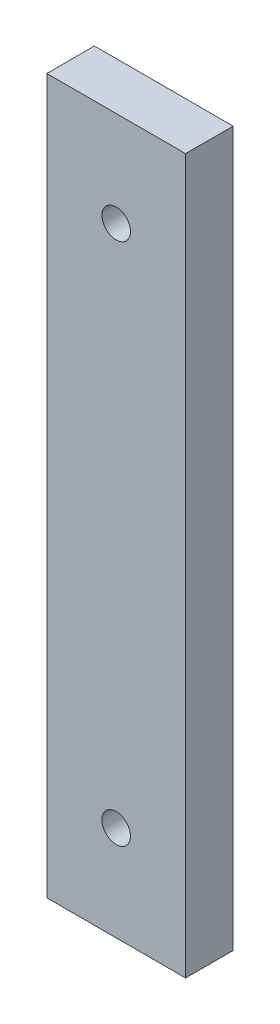
ISO-10303-21;
HEADER;
FILE_DESCRIPTION(('STEP AP214'),'2;1');
FILE_NAME('part.step','',(''),(''),'','','');
FILE_SCHEMA(('AUTOMOTIVE_DESIGN { 1 0 10303 214 1 1 1 1 }'));
ENDSEC;
DATA;
#1=APPLICATION_CONTEXT('core data for automotive mechanical design processes');
#2=APPLICATION_PROTOCOL_DEFINITION('international standard','automotive_design',2000,#1);
#3=PRODUCT_CONTEXT('',#1,'mechanical');
#4=PRODUCT('Part','Part','',(#3));
#5=PRODUCT_RELATED_PRODUCT_CATEGORY('part','',(#4));
#6=PRODUCT_DEFINITION_FORMATION('','',#4);
#7=PRODUCT_DEFINITION_CONTEXT('part definition',#1,'design');
#8=PRODUCT_DEFINITION('design','',#6,#7);
#9=PRODUCT_DEFINITION_SHAPE('','',#8);
#10=(LENGTH_UNIT() NAMED_UNIT(*) SI_UNIT(.MILLI.,.METRE.));
#11=(NAMED_UNIT(*) PLANE_ANGLE_UNIT() SI_UNIT($,.RADIAN.));
#12=(NAMED_UNIT(*) SI_UNIT($,.STERADIAN.) SOLID_ANGLE_UNIT());
#13=UNCERTAINTY_MEASURE_WITH_UNIT(LENGTH_MEASURE(1.E-05),#10,'distance_accuracy_value','');
#14=(GEOMETRIC_REPRESENTATION_CONTEXT(3) GLOBAL_UNCERTAINTY_ASSIGNED_CONTEXT((#13)) GLOBAL_UNIT_ASSIGNED_CONTEXT((#10,
#11,#12)) REPRESENTATION_CONTEXT('',''));
#15=CARTESIAN_POINT('',(0.,0.,0.));
#16=DIRECTION('',(0.,0.,1.));
#17=DIRECTION('',(1.,0.,0.));
#18=AXIS2_PLACEMENT_3D('',#15,#16,#17);
#19=CARTESIAN_POINT('',(0.,0.,10.));
#20=DIRECTION('',(0.,0.,-1.));
#21=DIRECTION('',(-1.,0.,0.));
#22=AXIS2_PLACEMENT_3D('',#19,#20,#21);
#23=PLANE('',#22);
#24=DIRECTION('',(0.,1.,0.));
#25=VECTOR('',#24,1.);
#26=CARTESIAN_POINT('',(14.5788336933045,-75.,10.));
#27=LINE('',#26,#25);
#28=CARTESIAN_POINT('',(14.5788336933045,-75.,10.));
#29=VERTEX_POINT('',#28);
#30=CARTESIAN_POINT('',(14.5788336933045,75.,10.));
#31=VERTEX_POINT('',#30);
#32=EDGE_CURVE('E92',#29,#31,#27,.T.);
#33=ORIENTED_EDGE('',*,*,#32,.T.);
#34=DIRECTION('',(-1.,0.,0.));
#35=VECTOR('',#34,1.);
#36=CARTESIAN_POINT('',(-14.5788336933045,75.,10.));
#37=LINE('',#36,#35);
#38=CARTESIAN_POINT('',(-14.5788336933045,75.,10.));
#39=VERTEX_POINT('',#38);
#40=EDGE_CURVE('E87',#31,#39,#37,.T.);
#41=ORIENTED_EDGE('',*,*,#40,.T.);
#42=DIRECTION('',(0.,-1.,0.));
#43=VECTOR('',#42,1.);
#44=CARTESIAN_POINT('',(-14.5788336933045,-75.,10.));
#45=LINE('',#44,#43);
#46=CARTESIAN_POINT('',(-14.5788336933045,-75.,10.));
#47=VERTEX_POINT('',#46);
#48=EDGE_CURVE('E90',#39,#47,#45,.T.);
#49=ORIENTED_EDGE('',*,*,#48,.T.);
#50=DIRECTION('',(1.,0.,0.));
#51=VECTOR('',#50,1.);
#52=CARTESIAN_POINT('',(-14.5788336933045,-75.,10.));
#53=LINE('',#52,#51);
#54=EDGE_CURVE('E57',#47,#29,#53,.T.);
#55=ORIENTED_EDGE('',*,*,#54,.T.);
#56=EDGE_LOOP('',(#33,#41,#49,#55));
#57=FACE_BOUND('',#56,.T.);
#58=CARTESIAN_POINT('',(0.,55.,10.));
#59=DIRECTION('',(0.,0.,1.));
#60=DIRECTION('',(1.,0.,0.));
#61=AXIS2_PLACEMENT_3D('',#58,#59,#60);
#62=CIRCLE('',#61,3.);
#63=CARTESIAN_POINT('',(3.,55.,10.));
#64=VERTEX_POINT('',#63);
#65=EDGE_CURVE('E112',#64,#64,#62,.T.);
#66=ORIENTED_EDGE('',*,*,#65,.F.);
#67=EDGE_LOOP('',(#66));
#68=FACE_BOUND('',#67,.T.);
#69=CARTESIAN_POINT('',(0.,-55.,10.));
#70=DIRECTION('',(0.,0.,1.));
#71=DIRECTION('',(1.,0.,0.));
#72=AXIS2_PLACEMENT_3D('',#69,#70,#71);
#73=CIRCLE('',#72,3.);
#74=CARTESIAN_POINT('',(3.,-55.,10.));
#75=VERTEX_POINT('',#74);
#76=EDGE_CURVE('E134',#75,#75,#73,.T.);
#77=ORIENTED_EDGE('',*,*,#76,.F.);
#78=EDGE_LOOP('',(#77));
#79=FACE_BOUND('',#78,.T.);
#80=ADVANCED_FACE('F39',(#57,#68,#79),#23,.F.);
#81=CARTESIAN_POINT('',(0.,0.,0.));
#82=DIRECTION('',(0.,0.,-1.));
#83=DIRECTION('',(-1.,0.,0.));
#84=AXIS2_PLACEMENT_3D('',#81,#82,#83);
#85=PLANE('',#84);
#86=CARTESIAN_POINT('',(0.,55.,0.));
#87=DIRECTION('',(0.,0.,1.));
#88=DIRECTION('',(1.,0.,0.));
#89=AXIS2_PLACEMENT_3D('',#86,#87,#88);
#90=CIRCLE('',#89,3.);
#91=CARTESIAN_POINT('',(3.,55.,0.));
#92=VERTEX_POINT('',#91);
#93=EDGE_CURVE('E130',#92,#92,#90,.T.);
#94=ORIENTED_EDGE('',*,*,#93,.T.);
#95=EDGE_LOOP('',(#94));
#96=FACE_BOUND('',#95,.T.);
#97=DIRECTION('',(0.,1.,0.));
#98=VECTOR('',#97,1.);
#99=CARTESIAN_POINT('',(14.5788336933045,-75.,0.));
#100=LINE('',#99,#98);
#101=CARTESIAN_POINT('',(14.5788336933045,-75.,0.));
#102=VERTEX_POINT('',#101);
#103=CARTESIAN_POINT('',(14.5788336933045,75.,0.));
#104=VERTEX_POINT('',#103);
#105=EDGE_CURVE('E108',#102,#104,#100,.T.);
#106=ORIENTED_EDGE('',*,*,#105,.F.);
#107=DIRECTION('',(1.,0.,0.));
#108=VECTOR('',#107,1.);
#109=CARTESIAN_POINT('',(-14.5788336933045,-75.,0.));
#110=LINE('',#109,#108);
#111=CARTESIAN_POINT('',(-14.5788336933045,-75.,0.));
#112=VERTEX_POINT('',#111);
#113=EDGE_CURVE('E80',#112,#102,#110,.T.);
#114=ORIENTED_EDGE('',*,*,#113,.F.);
#115=DIRECTION('',(0.,-1.,0.));
#116=VECTOR('',#115,1.);
#117=CARTESIAN_POINT('',(-14.5788336933045,-75.,0.));
#118=LINE('',#117,#116);
#119=CARTESIAN_POINT('',(-14.5788336933045,75.,0.));
#120=VERTEX_POINT('',#119);
#121=EDGE_CURVE('E74',#120,#112,#118,.T.);
#122=ORIENTED_EDGE('',*,*,#121,.F.);
#123=DIRECTION('',(-1.,0.,0.));
#124=VECTOR('',#123,1.);
#125=CARTESIAN_POINT('',(-14.5788336933045,75.,0.));
#126=LINE('',#125,#124);
#127=EDGE_CURVE('E97',#104,#120,#126,.T.);
#128=ORIENTED_EDGE('',*,*,#127,.F.);
#129=EDGE_LOOP('',(#106,#114,#122,#128));
#130=FACE_BOUND('',#129,.T.);
#131=CARTESIAN_POINT('',(0.,-55.,0.));
#132=DIRECTION('',(0.,0.,1.));
#133=DIRECTION('',(1.,0.,0.));
#134=AXIS2_PLACEMENT_3D('',#131,#132,#133);
#135=CIRCLE('',#134,3.);
#136=CARTESIAN_POINT('',(3.,-55.,0.));
#137=VERTEX_POINT('',#136);
#138=EDGE_CURVE('E138',#137,#137,#135,.T.);
#139=ORIENTED_EDGE('',*,*,#138,.T.);
#140=EDGE_LOOP('',(#139));
#141=FACE_BOUND('',#140,.T.);
#142=ADVANCED_FACE('F125',(#96,#130,#141),#85,.T.);
#143=CARTESIAN_POINT('',(14.5788336933045,-75.,10.));
#144=DIRECTION('',(-1.,0.,0.));
#145=DIRECTION('',(0.,0.,1.));
#146=AXIS2_PLACEMENT_3D('',#143,#144,#145);
#147=PLANE('',#146);
#148=ORIENTED_EDGE('',*,*,#105,.T.);
#149=DIRECTION('',(0.,0.,-1.));
#150=VECTOR('',#149,1.);
#151=CARTESIAN_POINT('',(14.5788336933045,75.,10.));
#152=LINE('',#151,#150);
#153=EDGE_CURVE('E11',#31,#104,#152,.T.);
#154=ORIENTED_EDGE('',*,*,#153,.F.);
#155=ORIENTED_EDGE('',*,*,#32,.F.);
#156=DIRECTION('',(0.,0.,-1.));
#157=VECTOR('',#156,1.);
#158=CARTESIAN_POINT('',(14.5788336933045,-75.,10.));
#159=LINE('',#158,#157);
#160=EDGE_CURVE('E104',#29,#102,#159,.T.);
#161=ORIENTED_EDGE('',*,*,#160,.T.);
#162=EDGE_LOOP('',(#148,#154,#155,#161));
#163=FACE_BOUND('',#162,.T.);
#164=ADVANCED_FACE('F41',(#163),#147,.F.);
#165=CARTESIAN_POINT('',(-14.5788336933045,75.,10.));
#166=DIRECTION('',(0.,-1.,0.));
#167=DIRECTION('',(0.,0.,-1.));
#168=AXIS2_PLACEMENT_3D('',#165,#166,#167);
#169=PLANE('',#168);
#170=ORIENTED_EDGE('',*,*,#127,.T.);
#171=DIRECTION('',(0.,0.,-1.));
#172=VECTOR('',#171,1.);
#173=CARTESIAN_POINT('',(-14.5788336933045,75.,10.));
#174=LINE('',#173,#172);
#175=EDGE_CURVE('E49',#39,#120,#174,.T.);
#176=ORIENTED_EDGE('',*,*,#175,.F.);
#177=ORIENTED_EDGE('',*,*,#40,.F.);
#178=ORIENTED_EDGE('',*,*,#153,.T.);
#179=EDGE_LOOP('',(#170,#176,#177,#178));
#180=FACE_BOUND('',#179,.T.);
#181=ADVANCED_FACE('F96',(#180),#169,.F.);
#182=CARTESIAN_POINT('',(-14.5788336933045,-75.,10.));
#183=DIRECTION('',(1.,0.,0.));
#184=DIRECTION('',(0.,0.,-1.));
#185=AXIS2_PLACEMENT_3D('',#182,#183,#184);
#186=PLANE('',#185);
#187=ORIENTED_EDGE('',*,*,#121,.T.);
#188=DIRECTION('',(0.,0.,-1.));
#189=VECTOR('',#188,1.);
#190=CARTESIAN_POINT('',(-14.5788336933045,-75.,10.));
#191=LINE('',#190,#189);
#192=EDGE_CURVE('E99',#47,#112,#191,.T.);
#193=ORIENTED_EDGE('',*,*,#192,.F.);
#194=ORIENTED_EDGE('',*,*,#48,.F.);
#195=ORIENTED_EDGE('',*,*,#175,.T.);
#196=EDGE_LOOP('',(#187,#193,#194,#195));
#197=FACE_BOUND('',#196,.T.);
#198=ADVANCED_FACE('F100',(#197),#186,.F.);
#199=CARTESIAN_POINT('',(-14.5788336933045,-75.,10.));
#200=DIRECTION('',(0.,1.,0.));
#201=DIRECTION('',(0.,0.,1.));
#202=AXIS2_PLACEMENT_3D('',#199,#200,#201);
#203=PLANE('',#202);
#204=ORIENTED_EDGE('',*,*,#113,.T.);
#205=ORIENTED_EDGE('',*,*,#160,.F.);
#206=ORIENTED_EDGE('',*,*,#54,.F.);
#207=ORIENTED_EDGE('',*,*,#192,.T.);
#208=EDGE_LOOP('',(#204,#205,#206,#207));
#209=FACE_BOUND('',#208,.T.);
#210=ADVANCED_FACE('F122',(#209),#203,.F.);
#211=CARTESIAN_POINT('',(0.,55.,10.));
#212=DIRECTION('',(0.,0.,-1.));
#213=DIRECTION('',(-1.,0.,0.));
#214=AXIS2_PLACEMENT_3D('',#211,#212,#213);
#215=CYLINDRICAL_SURFACE('',#214,3.);
#216=ORIENTED_EDGE('',*,*,#65,.T.);
#217=EDGE_LOOP('',(#216));
#218=FACE_BOUND('',#217,.T.);
#219=ORIENTED_EDGE('',*,*,#93,.F.);
#220=EDGE_LOOP('',(#219));
#221=FACE_BOUND('',#220,.T.);
#222=ADVANCED_FACE('F157',(#218,#221),#215,.F.);
#223=CARTESIAN_POINT('',(0.,-55.,10.));
#224=DIRECTION('',(0.,0.,-1.));
#225=DIRECTION('',(-1.,0.,0.));
#226=AXIS2_PLACEMENT_3D('',#223,#224,#225);
#227=CYLINDRICAL_SURFACE('',#226,3.);
#228=ORIENTED_EDGE('',*,*,#76,.T.);
#229=EDGE_LOOP('',(#228));
#230=FACE_BOUND('',#229,.T.);
#231=ORIENTED_EDGE('',*,*,#138,.F.);
#232=EDGE_LOOP('',(#231));
#233=FACE_BOUND('',#232,.T.);
#234=ADVANCED_FACE('F146',(#230,#233),#227,.F.);
#235=CLOSED_SHELL('',(#80,#142,#164,#181,#198,#210,#222,#234));
#236=MANIFOLD_SOLID_BREP('B2',#235);
#237=ADVANCED_BREP_SHAPE_REPRESENTATION('',(#18,#236),#14);
#238=SHAPE_DEFINITION_REPRESENTATION(#9,#237);
ENDSEC;
END-ISO-10303-21;
